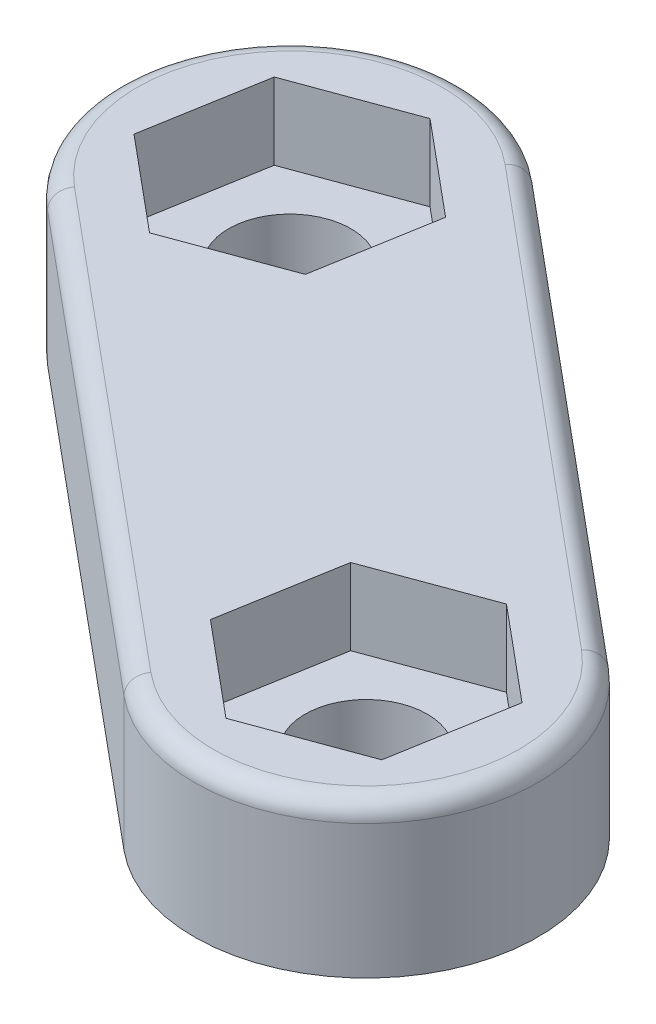
ISO-10303-21;
HEADER;
FILE_DESCRIPTION(('STEP AP214'),'2;1');
FILE_NAME('part.step','',(''),(''),'','','');
FILE_SCHEMA(('AUTOMOTIVE_DESIGN { 1 0 10303 214 1 1 1 1 }'));
ENDSEC;
DATA;
#1=APPLICATION_CONTEXT('core data for automotive mechanical design processes');
#2=APPLICATION_PROTOCOL_DEFINITION('international standard','automotive_design',2000,#1);
#3=PRODUCT_CONTEXT('',#1,'mechanical');
#4=PRODUCT('Part','Part','',(#3));
#5=PRODUCT_RELATED_PRODUCT_CATEGORY('part','',(#4));
#6=PRODUCT_DEFINITION_FORMATION('','',#4);
#7=PRODUCT_DEFINITION_CONTEXT('part definition',#1,'design');
#8=PRODUCT_DEFINITION('design','',#6,#7);
#9=PRODUCT_DEFINITION_SHAPE('','',#8);
#10=(LENGTH_UNIT() NAMED_UNIT(*) SI_UNIT(.MILLI.,.METRE.));
#11=(NAMED_UNIT(*) PLANE_ANGLE_UNIT() SI_UNIT($,.RADIAN.));
#12=(NAMED_UNIT(*) SI_UNIT($,.STERADIAN.) SOLID_ANGLE_UNIT());
#13=UNCERTAINTY_MEASURE_WITH_UNIT(LENGTH_MEASURE(1.E-05),#10,'distance_accuracy_value','');
#14=(GEOMETRIC_REPRESENTATION_CONTEXT(3) GLOBAL_UNCERTAINTY_ASSIGNED_CONTEXT((#13)) GLOBAL_UNIT_ASSIGNED_CONTEXT((#10,
#11,#12)) REPRESENTATION_CONTEXT('',''));
#15=CARTESIAN_POINT('',(0.,0.,0.));
#16=DIRECTION('',(0.,0.,1.));
#17=DIRECTION('',(1.,0.,0.));
#18=AXIS2_PLACEMENT_3D('',#15,#16,#17);
#19=CARTESIAN_POINT('',(-6.,4.,-5.));
#20=DIRECTION('',(0.,-1.,0.));
#21=DIRECTION('',(0.,0.,-1.));
#22=AXIS2_PLACEMENT_3D('',#19,#20,#21);
#23=CYLINDRICAL_SURFACE('',#22,1.6);
#24=CARTESIAN_POINT('',(-6.,0.,-5.));
#25=DIRECTION('',(0.,1.,0.));
#26=DIRECTION('',(0.,0.,1.));
#27=AXIS2_PLACEMENT_3D('',#24,#25,#26);
#28=CIRCLE('',#27,1.6);
#29=CARTESIAN_POINT('',(-6.,0.,-3.4));
#30=VERTEX_POINT('',#29);
#31=EDGE_CURVE('E286',#30,#30,#28,.T.);
#32=ORIENTED_EDGE('',*,*,#31,.F.);
#33=EDGE_LOOP('',(#32));
#34=FACE_BOUND('',#33,.T.);
#35=CARTESIAN_POINT('',(-6.,2.,-5.));
#36=DIRECTION('',(0.,1.,0.));
#37=DIRECTION('',(0.,0.,1.));
#38=AXIS2_PLACEMENT_3D('',#35,#36,#37);
#39=CIRCLE('',#38,1.6);
#40=CARTESIAN_POINT('',(-6.,2.,-3.4));
#41=VERTEX_POINT('',#40);
#42=EDGE_CURVE('E215',#41,#41,#39,.T.);
#43=ORIENTED_EDGE('',*,*,#42,.T.);
#44=EDGE_LOOP('',(#43));
#45=FACE_BOUND('',#44,.T.);
#46=ADVANCED_FACE('F37',(#34,#45),#23,.F.);
#47=CARTESIAN_POINT('',(-2.88082979849016,4.,3.45699575818819));
#48=DIRECTION('',(0.64018439966448,0.,-0.768221279597376));
#49=DIRECTION('',(-0.768221279597376,0.,-0.64018439966448));
#50=AXIS2_PLACEMENT_3D('',#47,#48,#49);
#51=PLANE('',#50);
#52=DIRECTION('',(0.,-1.,0.));
#53=VECTOR('',#52,1.);
#54=CARTESIAN_POINT('',(3.11917020150984,4.,8.45699575818819));
#55=LINE('',#54,#53);
#56=CARTESIAN_POINT('',(3.11917020150984,3.5,8.45699575818819));
#57=VERTEX_POINT('',#56);
#58=CARTESIAN_POINT('',(3.11917020150984,0.,8.45699575818819));
#59=VERTEX_POINT('',#58);
#60=EDGE_CURVE('E295',#57,#59,#55,.T.);
#61=ORIENTED_EDGE('',*,*,#60,.F.);
#62=DIRECTION('',(0.768221279597376,0.,0.64018439966448));
#63=VECTOR('',#62,1.);
#64=CARTESIAN_POINT('',(-8.88082979849016,3.5,-1.54300424181181));
#65=LINE('',#64,#63);
#66=CARTESIAN_POINT('',(-8.88082979849016,3.5,-1.54300424181181));
#67=VERTEX_POINT('',#66);
#68=EDGE_CURVE('E11',#57,#67,#65,.F.);
#69=ORIENTED_EDGE('',*,*,#68,.T.);
#70=DIRECTION('',(0.,-1.,0.));
#71=VECTOR('',#70,1.);
#72=CARTESIAN_POINT('',(-8.88082979849016,4.,-1.54300424181181));
#73=LINE('',#72,#71);
#74=CARTESIAN_POINT('',(-8.88082979849016,0.,-1.54300424181181));
#75=VERTEX_POINT('',#74);
#76=EDGE_CURVE('E289',#67,#75,#73,.T.);
#77=ORIENTED_EDGE('',*,*,#76,.T.);
#78=DIRECTION('',(0.768221279597376,0.,0.64018439966448));
#79=VECTOR('',#78,1.);
#80=CARTESIAN_POINT('',(-2.88082979849016,0.,3.45699575818819));
#81=LINE('',#80,#79);
#82=EDGE_CURVE('E273',#75,#59,#81,.T.);
#83=ORIENTED_EDGE('',*,*,#82,.T.);
#84=EDGE_LOOP('',(#61,#69,#77,#83));
#85=FACE_BOUND('',#84,.T.);
#86=ADVANCED_FACE('F336',(#85),#51,.F.);
#87=CARTESIAN_POINT('',(6.,4.,5.));
#88=DIRECTION('',(0.,-1.,0.));
#89=DIRECTION('',(0.,0.,-1.));
#90=AXIS2_PLACEMENT_3D('',#87,#88,#89);
#91=CYLINDRICAL_SURFACE('',#90,4.5);
#92=DIRECTION('',(0.,-1.,0.));
#93=VECTOR('',#92,1.);
#94=CARTESIAN_POINT('',(8.88082979849016,4.,1.54300424181181));
#95=LINE('',#94,#93);
#96=CARTESIAN_POINT('',(8.88082979849016,3.5,1.54300424181181));
#97=VERTEX_POINT('',#96);
#98=CARTESIAN_POINT('',(8.88082979849016,0.,1.54300424181181));
#99=VERTEX_POINT('',#98);
#100=EDGE_CURVE('E293',#97,#99,#95,.T.);
#101=ORIENTED_EDGE('',*,*,#100,.F.);
#102=CARTESIAN_POINT('',(6.,3.5,5.));
#103=DIRECTION('',(0.,1.,0.));
#104=DIRECTION('',(0.,0.,1.));
#105=AXIS2_PLACEMENT_3D('',#102,#103,#104);
#106=CIRCLE('',#105,4.5);
#107=EDGE_CURVE('E46',#97,#57,#106,.F.);
#108=ORIENTED_EDGE('',*,*,#107,.T.);
#109=ORIENTED_EDGE('',*,*,#60,.T.);
#110=CARTESIAN_POINT('',(6.,0.,5.));
#111=DIRECTION('',(0.,1.,0.));
#112=DIRECTION('',(0.,0.,1.));
#113=AXIS2_PLACEMENT_3D('',#110,#111,#112);
#114=CIRCLE('',#113,4.5);
#115=EDGE_CURVE('E277',#59,#99,#114,.T.);
#116=ORIENTED_EDGE('',*,*,#115,.T.);
#117=EDGE_LOOP('',(#101,#108,#109,#116));
#118=FACE_BOUND('',#117,.T.);
#119=ADVANCED_FACE('F394',(#118),#91,.T.);
#120=CARTESIAN_POINT('',(2.88082979849016,4.,-3.45699575818819));
#121=DIRECTION('',(0.64018439966448,0.,-0.768221279597376));
#122=DIRECTION('',(-0.768221279597376,0.,-0.64018439966448));
#123=AXIS2_PLACEMENT_3D('',#120,#121,#122);
#124=PLANE('',#123);
#125=DIRECTION('',(0.,-1.,0.));
#126=VECTOR('',#125,1.);
#127=CARTESIAN_POINT('',(-3.11917020150984,4.,-8.45699575818819));
#128=LINE('',#127,#126);
#129=CARTESIAN_POINT('',(-3.11917020150984,3.5,-8.45699575818819));
#130=VERTEX_POINT('',#129);
#131=CARTESIAN_POINT('',(-3.11917020150984,0.,-8.45699575818819));
#132=VERTEX_POINT('',#131);
#133=EDGE_CURVE('E291',#130,#132,#128,.T.);
#134=ORIENTED_EDGE('',*,*,#133,.F.);
#135=DIRECTION('',(0.768221279597376,0.,0.64018439966448));
#136=VECTOR('',#135,1.);
#137=CARTESIAN_POINT('',(2.88082979849016,3.5,-3.45699575818819));
#138=LINE('',#137,#136);
#139=EDGE_CURVE('E61',#130,#97,#138,.T.);
#140=ORIENTED_EDGE('',*,*,#139,.T.);
#141=ORIENTED_EDGE('',*,*,#100,.T.);
#142=DIRECTION('',(0.768221279597376,0.,0.64018439966448));
#143=VECTOR('',#142,1.);
#144=CARTESIAN_POINT('',(2.88082979849016,0.,-3.45699575818819));
#145=LINE('',#144,#143);
#146=EDGE_CURVE('E280',#132,#99,#145,.T.);
#147=ORIENTED_EDGE('',*,*,#146,.F.);
#148=EDGE_LOOP('',(#134,#140,#141,#147));
#149=FACE_BOUND('',#148,.T.);
#150=ADVANCED_FACE('F402',(#149),#124,.T.);
#151=CARTESIAN_POINT('',(-6.,4.,-5.));
#152=DIRECTION('',(0.,-1.,0.));
#153=DIRECTION('',(0.,0.,-1.));
#154=AXIS2_PLACEMENT_3D('',#151,#152,#153);
#155=CYLINDRICAL_SURFACE('',#154,4.5);
#156=ORIENTED_EDGE('',*,*,#76,.F.);
#157=CARTESIAN_POINT('',(-6.,3.5,-5.));
#158=DIRECTION('',(0.,1.,0.));
#159=DIRECTION('',(0.,0.,1.));
#160=AXIS2_PLACEMENT_3D('',#157,#158,#159);
#161=CIRCLE('',#160,4.5);
#162=EDGE_CURVE('E310',#67,#130,#161,.F.);
#163=ORIENTED_EDGE('',*,*,#162,.T.);
#164=ORIENTED_EDGE('',*,*,#133,.T.);
#165=CARTESIAN_POINT('',(-6.,0.,-5.));
#166=DIRECTION('',(0.,1.,0.));
#167=DIRECTION('',(0.,0.,1.));
#168=AXIS2_PLACEMENT_3D('',#165,#166,#167);
#169=CIRCLE('',#168,4.5);
#170=EDGE_CURVE('E283',#132,#75,#169,.T.);
#171=ORIENTED_EDGE('',*,*,#170,.T.);
#172=EDGE_LOOP('',(#156,#163,#164,#171));
#173=FACE_BOUND('',#172,.T.);
#174=ADVANCED_FACE('F339',(#173),#155,.T.);
#175=CARTESIAN_POINT('',(6.,4.,5.));
#176=DIRECTION('',(0.,-1.,0.));
#177=DIRECTION('',(0.,0.,-1.));
#178=AXIS2_PLACEMENT_3D('',#175,#176,#177);
#179=CYLINDRICAL_SURFACE('',#178,1.6);
#180=CARTESIAN_POINT('',(6.,2.,5.));
#181=DIRECTION('',(0.,-1.,0.));
#182=DIRECTION('',(0.,0.,-1.));
#183=AXIS2_PLACEMENT_3D('',#180,#181,#182);
#184=CIRCLE('',#183,1.6);
#185=CARTESIAN_POINT('',(6.,2.,3.4));
#186=VERTEX_POINT('',#185);
#187=EDGE_CURVE('E274',#186,#186,#184,.T.);
#188=ORIENTED_EDGE('',*,*,#187,.F.);
#189=EDGE_LOOP('',(#188));
#190=FACE_BOUND('',#189,.T.);
#191=CARTESIAN_POINT('',(6.,0.,5.));
#192=DIRECTION('',(0.,1.,0.));
#193=DIRECTION('',(0.,0.,1.));
#194=AXIS2_PLACEMENT_3D('',#191,#192,#193);
#195=CIRCLE('',#194,1.6);
#196=CARTESIAN_POINT('',(6.,0.,6.6));
#197=VERTEX_POINT('',#196);
#198=EDGE_CURVE('E270',#197,#197,#195,.T.);
#199=ORIENTED_EDGE('',*,*,#198,.F.);
#200=EDGE_LOOP('',(#199));
#201=FACE_BOUND('',#200,.T.);
#202=ADVANCED_FACE('F350',(#190,#201),#179,.F.);
#203=CARTESIAN_POINT('',(0.,4.,0.));
#204=DIRECTION('',(0.,1.,0.));
#205=DIRECTION('',(0.,0.,1.));
#206=AXIS2_PLACEMENT_3D('',#203,#204,#205);
#207=PLANE('',#206);
#208=DIRECTION('',(0.768221279597376,0.,0.64018439966448));
#209=VECTOR('',#208,1.);
#210=CARTESIAN_POINT('',(2.56073759865792,4.,-3.0728851183895));
#211=LINE('',#210,#209);
#212=CARTESIAN_POINT('',(8.56073759865792,4.,1.9271148816105));
#213=VERTEX_POINT('',#212);
#214=CARTESIAN_POINT('',(-3.43926240134208,4.,-8.0728851183895));
#215=VERTEX_POINT('',#214);
#216=EDGE_CURVE('E305',#213,#215,#211,.F.);
#217=ORIENTED_EDGE('',*,*,#216,.T.);
#218=CARTESIAN_POINT('',(-6.,4.,-5.));
#219=DIRECTION('',(0.,1.,0.));
#220=DIRECTION('',(0.,0.,1.));
#221=AXIS2_PLACEMENT_3D('',#218,#219,#220);
#222=CIRCLE('',#221,4.);
#223=CARTESIAN_POINT('',(-8.56073759865792,4.,-1.9271148816105));
#224=VERTEX_POINT('',#223);
#225=EDGE_CURVE('E307',#215,#224,#222,.T.);
#226=ORIENTED_EDGE('',*,*,#225,.T.);
#227=DIRECTION('',(0.768221279597376,0.,0.64018439966448));
#228=VECTOR('',#227,1.);
#229=CARTESIAN_POINT('',(3.43926240134208,4.,8.0728851183895));
#230=LINE('',#229,#228);
#231=CARTESIAN_POINT('',(3.43926240134208,4.,8.0728851183895));
#232=VERTEX_POINT('',#231);
#233=EDGE_CURVE('E297',#224,#232,#230,.T.);
#234=ORIENTED_EDGE('',*,*,#233,.T.);
#235=CARTESIAN_POINT('',(6.,4.,5.));
#236=DIRECTION('',(0.,1.,0.));
#237=DIRECTION('',(0.,0.,1.));
#238=AXIS2_PLACEMENT_3D('',#235,#236,#237);
#239=CIRCLE('',#238,4.);
#240=EDGE_CURVE('E303',#232,#213,#239,.T.);
#241=ORIENTED_EDGE('',*,*,#240,.T.);
#242=EDGE_LOOP('',(#217,#226,#234,#241));
#243=FACE_BOUND('',#242,.T.);
#244=DIRECTION('',(-0.938526593014617,0.,0.345206944026876));
#245=VECTOR('',#244,1.);
#246=CARTESIAN_POINT('',(-5.45920799799773,4.,-8.12903776645532));
#247=LINE('',#246,#245);
#248=CARTESIAN_POINT('',(-5.45920799799773,4.,-8.12903776645532));
#249=VERTEX_POINT('',#248);
#250=CARTESIAN_POINT('',(-8.43943019415009,4.,-7.03285849512508));
#251=VERTEX_POINT('',#250);
#252=EDGE_CURVE('E170',#249,#251,#247,.T.);
#253=ORIENTED_EDGE('',*,*,#252,.F.);
#254=DIRECTION('',(-0.768221279597376,0.,-0.64018439966448));
#255=VECTOR('',#254,1.);
#256=CARTESIAN_POINT('',(-3.01977780384764,4.,-6.09617927133025));
#257=LINE('',#256,#255);
#258=CARTESIAN_POINT('',(-3.01977780384764,4.,-6.09617927133025));
#259=VERTEX_POINT('',#258);
#260=EDGE_CURVE('E188',#259,#249,#257,.T.);
#261=ORIENTED_EDGE('',*,*,#260,.F.);
#262=DIRECTION('',(0.170305313417241,0.,-0.985391343691356));
#263=VECTOR('',#262,1.);
#264=CARTESIAN_POINT('',(-3.56056980584991,4.,-2.96714150487492));
#265=LINE('',#264,#263);
#266=CARTESIAN_POINT('',(-3.56056980584991,4.,-2.96714150487492));
#267=VERTEX_POINT('',#266);
#268=EDGE_CURVE('E191',#267,#259,#265,.T.);
#269=ORIENTED_EDGE('',*,*,#268,.F.);
#270=DIRECTION('',(0.938526593014617,0.,-0.345206944026876));
#271=VECTOR('',#270,1.);
#272=CARTESIAN_POINT('',(-6.54079200200227,4.,-1.87096223354468));
#273=LINE('',#272,#271);
#274=CARTESIAN_POINT('',(-6.54079200200227,4.,-1.87096223354468));
#275=VERTEX_POINT('',#274);
#276=EDGE_CURVE('E208',#275,#267,#273,.T.);
#277=ORIENTED_EDGE('',*,*,#276,.F.);
#278=DIRECTION('',(0.768221279597376,0.,0.64018439966448));
#279=VECTOR('',#278,1.);
#280=CARTESIAN_POINT('',(-8.98022219615236,4.,-3.90382072866975));
#281=LINE('',#280,#279);
#282=CARTESIAN_POINT('',(-8.98022219615236,4.,-3.90382072866975));
#283=VERTEX_POINT('',#282);
#284=EDGE_CURVE('E205',#283,#275,#281,.T.);
#285=ORIENTED_EDGE('',*,*,#284,.F.);
#286=DIRECTION('',(-0.170305313417241,0.,0.985391343691356));
#287=VECTOR('',#286,1.);
#288=CARTESIAN_POINT('',(-8.43943019415009,4.,-7.03285849512508));
#289=LINE('',#288,#287);
#290=EDGE_CURVE('E202',#251,#283,#289,.T.);
#291=ORIENTED_EDGE('',*,*,#290,.F.);
#292=EDGE_LOOP('',(#253,#261,#269,#277,#285,#291));
#293=FACE_BOUND('',#292,.T.);
#294=DIRECTION('',(0.938526593014617,0.,-0.345206944026876));
#295=VECTOR('',#294,1.);
#296=CARTESIAN_POINT('',(8.43943019415009,4.,7.03285849512507));
#297=LINE('',#296,#295);
#298=CARTESIAN_POINT('',(5.45920799799773,4.,8.12903776645532));
#299=VERTEX_POINT('',#298);
#300=CARTESIAN_POINT('',(8.43943019415009,4.,7.03285849512507));
#301=VERTEX_POINT('',#300);
#302=EDGE_CURVE('E243',#299,#301,#297,.T.);
#303=ORIENTED_EDGE('',*,*,#302,.F.);
#304=DIRECTION('',(0.768221279597376,0.,0.64018439966448));
#305=VECTOR('',#304,1.);
#306=CARTESIAN_POINT('',(5.45920799799773,4.,8.12903776645532));
#307=LINE('',#306,#305);
#308=CARTESIAN_POINT('',(3.01977780384764,4.,6.09617927133024));
#309=VERTEX_POINT('',#308);
#310=EDGE_CURVE('E227',#309,#299,#307,.T.);
#311=ORIENTED_EDGE('',*,*,#310,.F.);
#312=DIRECTION('',(-0.170305313417241,0.,0.985391343691356));
#313=VECTOR('',#312,1.);
#314=CARTESIAN_POINT('',(3.01977780384764,4.,6.09617927133024));
#315=LINE('',#314,#313);
#316=CARTESIAN_POINT('',(3.56056980584991,4.,2.96714150487492));
#317=VERTEX_POINT('',#316);
#318=EDGE_CURVE('E254',#317,#309,#315,.T.);
#319=ORIENTED_EDGE('',*,*,#318,.F.);
#320=DIRECTION('',(-0.938526593014617,0.,0.345206944026876));
#321=VECTOR('',#320,1.);
#322=CARTESIAN_POINT('',(3.56056980584991,4.,2.96714150487492));
#323=LINE('',#322,#321);
#324=CARTESIAN_POINT('',(6.54079200200228,4.,1.87096223354468));
#325=VERTEX_POINT('',#324);
#326=EDGE_CURVE('E251',#325,#317,#323,.T.);
#327=ORIENTED_EDGE('',*,*,#326,.F.);
#328=DIRECTION('',(-0.768221279597376,0.,-0.64018439966448));
#329=VECTOR('',#328,1.);
#330=CARTESIAN_POINT('',(6.54079200200228,4.,1.87096223354468));
#331=LINE('',#330,#329);
#332=CARTESIAN_POINT('',(8.98022219615237,4.,3.90382072866975));
#333=VERTEX_POINT('',#332);
#334=EDGE_CURVE('E248',#333,#325,#331,.T.);
#335=ORIENTED_EDGE('',*,*,#334,.F.);
#336=DIRECTION('',(0.170305313417242,0.,-0.985391343691355));
#337=VECTOR('',#336,1.);
#338=CARTESIAN_POINT('',(8.98022219615237,4.,3.90382072866975));
#339=LINE('',#338,#337);
#340=EDGE_CURVE('E245',#301,#333,#339,.T.);
#341=ORIENTED_EDGE('',*,*,#340,.F.);
#342=EDGE_LOOP('',(#303,#311,#319,#327,#335,#341));
#343=FACE_BOUND('',#342,.T.);
#344=ADVANCED_FACE('F346',(#243,#293,#343),#207,.T.);
#345=CARTESIAN_POINT('',(0.,0.,0.));
#346=DIRECTION('',(0.,1.,0.));
#347=DIRECTION('',(0.,0.,1.));
#348=AXIS2_PLACEMENT_3D('',#345,#346,#347);
#349=PLANE('',#348);
#350=ORIENTED_EDGE('',*,*,#198,.T.);
#351=EDGE_LOOP('',(#350));
#352=FACE_BOUND('',#351,.T.);
#353=ORIENTED_EDGE('',*,*,#82,.F.);
#354=ORIENTED_EDGE('',*,*,#170,.F.);
#355=ORIENTED_EDGE('',*,*,#146,.T.);
#356=ORIENTED_EDGE('',*,*,#115,.F.);
#357=EDGE_LOOP('',(#353,#354,#355,#356));
#358=FACE_BOUND('',#357,.T.);
#359=ORIENTED_EDGE('',*,*,#31,.T.);
#360=EDGE_LOOP('',(#359));
#361=FACE_BOUND('',#360,.T.);
#362=ADVANCED_FACE('F349',(#352,#358,#361),#349,.F.);
#363=CARTESIAN_POINT('',(8.43943019415009,2.,7.03285849512507));
#364=DIRECTION('',(0.345206944026876,0.,0.938526593014617));
#365=DIRECTION('',(0.938526593014617,0.,-0.345206944026876));
#366=AXIS2_PLACEMENT_3D('',#363,#364,#365);
#367=PLANE('',#366);
#368=ORIENTED_EDGE('',*,*,#302,.T.);
#369=DIRECTION('',(0.,1.,0.));
#370=VECTOR('',#369,1.);
#371=CARTESIAN_POINT('',(8.43943019415009,2.,7.03285849512507));
#372=LINE('',#371,#370);
#373=CARTESIAN_POINT('',(8.43943019415009,2.,7.03285849512507));
#374=VERTEX_POINT('',#373);
#375=EDGE_CURVE('E242',#374,#301,#372,.T.);
#376=ORIENTED_EDGE('',*,*,#375,.F.);
#377=DIRECTION('',(0.938526593014617,0.,-0.345206944026876));
#378=VECTOR('',#377,1.);
#379=CARTESIAN_POINT('',(8.43943019415009,2.,7.03285849512507));
#380=LINE('',#379,#378);
#381=CARTESIAN_POINT('',(5.45920799799773,2.,8.12903776645532));
#382=VERTEX_POINT('',#381);
#383=EDGE_CURVE('E223',#382,#374,#380,.T.);
#384=ORIENTED_EDGE('',*,*,#383,.F.);
#385=DIRECTION('',(0.,1.,0.));
#386=VECTOR('',#385,1.);
#387=CARTESIAN_POINT('',(5.45920799799773,2.,8.12903776645532));
#388=LINE('',#387,#386);
#389=EDGE_CURVE('E203',#382,#299,#388,.T.);
#390=ORIENTED_EDGE('',*,*,#389,.T.);
#391=EDGE_LOOP('',(#368,#376,#384,#390));
#392=FACE_BOUND('',#391,.T.);
#393=ADVANCED_FACE('F360',(#392),#367,.F.);
#394=CARTESIAN_POINT('',(5.45920799799773,2.,8.12903776645532));
#395=DIRECTION('',(-0.64018439966448,0.,0.768221279597376));
#396=DIRECTION('',(0.768221279597376,0.,0.64018439966448));
#397=AXIS2_PLACEMENT_3D('',#394,#395,#396);
#398=PLANE('',#397);
#399=ORIENTED_EDGE('',*,*,#310,.T.);
#400=ORIENTED_EDGE('',*,*,#389,.F.);
#401=DIRECTION('',(0.768221279597376,0.,0.64018439966448));
#402=VECTOR('',#401,1.);
#403=CARTESIAN_POINT('',(5.45920799799773,2.,8.12903776645532));
#404=LINE('',#403,#402);
#405=CARTESIAN_POINT('',(3.01977780384764,2.,6.09617927133024));
#406=VERTEX_POINT('',#405);
#407=EDGE_CURVE('E239',#406,#382,#404,.T.);
#408=ORIENTED_EDGE('',*,*,#407,.F.);
#409=DIRECTION('',(0.,1.,0.));
#410=VECTOR('',#409,1.);
#411=CARTESIAN_POINT('',(3.01977780384764,2.,6.09617927133024));
#412=LINE('',#411,#410);
#413=EDGE_CURVE('E260',#406,#309,#412,.T.);
#414=ORIENTED_EDGE('',*,*,#413,.T.);
#415=EDGE_LOOP('',(#399,#400,#408,#414));
#416=FACE_BOUND('',#415,.T.);
#417=ADVANCED_FACE('F371',(#416),#398,.F.);
#418=CARTESIAN_POINT('',(3.01977780384764,2.,6.09617927133024));
#419=DIRECTION('',(-0.985391343691356,0.,-0.170305313417241));
#420=DIRECTION('',(-0.170305313417241,0.,0.985391343691356));
#421=AXIS2_PLACEMENT_3D('',#418,#419,#420);
#422=PLANE('',#421);
#423=ORIENTED_EDGE('',*,*,#318,.T.);
#424=ORIENTED_EDGE('',*,*,#413,.F.);
#425=DIRECTION('',(-0.170305313417241,0.,0.985391343691356));
#426=VECTOR('',#425,1.);
#427=CARTESIAN_POINT('',(3.01977780384764,2.,6.09617927133024));
#428=LINE('',#427,#426);
#429=CARTESIAN_POINT('',(3.56056980584991,2.,2.96714150487492));
#430=VERTEX_POINT('',#429);
#431=EDGE_CURVE('E236',#430,#406,#428,.T.);
#432=ORIENTED_EDGE('',*,*,#431,.F.);
#433=DIRECTION('',(0.,1.,0.));
#434=VECTOR('',#433,1.);
#435=CARTESIAN_POINT('',(3.56056980584991,2.,2.96714150487492));
#436=LINE('',#435,#434);
#437=EDGE_CURVE('E262',#430,#317,#436,.T.);
#438=ORIENTED_EDGE('',*,*,#437,.T.);
#439=EDGE_LOOP('',(#423,#424,#432,#438));
#440=FACE_BOUND('',#439,.T.);
#441=ADVANCED_FACE('F373',(#440),#422,.F.);
#442=CARTESIAN_POINT('',(3.56056980584991,2.,2.96714150487492));
#443=DIRECTION('',(-0.345206944026876,0.,-0.938526593014618));
#444=DIRECTION('',(-0.938526593014618,0.,0.345206944026876));
#445=AXIS2_PLACEMENT_3D('',#442,#443,#444);
#446=PLANE('',#445);
#447=ORIENTED_EDGE('',*,*,#326,.T.);
#448=ORIENTED_EDGE('',*,*,#437,.F.);
#449=DIRECTION('',(-0.938526593014617,0.,0.345206944026876));
#450=VECTOR('',#449,1.);
#451=CARTESIAN_POINT('',(3.56056980584991,2.,2.96714150487492));
#452=LINE('',#451,#450);
#453=CARTESIAN_POINT('',(6.54079200200228,2.,1.87096223354468));
#454=VERTEX_POINT('',#453);
#455=EDGE_CURVE('E233',#454,#430,#452,.T.);
#456=ORIENTED_EDGE('',*,*,#455,.F.);
#457=DIRECTION('',(0.,1.,0.));
#458=VECTOR('',#457,1.);
#459=CARTESIAN_POINT('',(6.54079200200228,2.,1.87096223354468));
#460=LINE('',#459,#458);
#461=EDGE_CURVE('E264',#454,#325,#460,.T.);
#462=ORIENTED_EDGE('',*,*,#461,.T.);
#463=EDGE_LOOP('',(#447,#448,#456,#462));
#464=FACE_BOUND('',#463,.T.);
#465=ADVANCED_FACE('F376',(#464),#446,.F.);
#466=CARTESIAN_POINT('',(6.54079200200228,2.,1.87096223354468));
#467=DIRECTION('',(0.64018439966448,0.,-0.768221279597376));
#468=DIRECTION('',(-0.768221279597376,0.,-0.64018439966448));
#469=AXIS2_PLACEMENT_3D('',#466,#467,#468);
#470=PLANE('',#469);
#471=ORIENTED_EDGE('',*,*,#334,.T.);
#472=ORIENTED_EDGE('',*,*,#461,.F.);
#473=DIRECTION('',(-0.768221279597376,0.,-0.64018439966448));
#474=VECTOR('',#473,1.);
#475=CARTESIAN_POINT('',(6.54079200200228,2.,1.87096223354468));
#476=LINE('',#475,#474);
#477=CARTESIAN_POINT('',(8.98022219615237,2.,3.90382072866975));
#478=VERTEX_POINT('',#477);
#479=EDGE_CURVE('E230',#478,#454,#476,.T.);
#480=ORIENTED_EDGE('',*,*,#479,.F.);
#481=DIRECTION('',(0.,1.,0.));
#482=VECTOR('',#481,1.);
#483=CARTESIAN_POINT('',(8.98022219615237,2.,3.90382072866975));
#484=LINE('',#483,#482);
#485=EDGE_CURVE('E266',#478,#333,#484,.T.);
#486=ORIENTED_EDGE('',*,*,#485,.T.);
#487=EDGE_LOOP('',(#471,#472,#480,#486));
#488=FACE_BOUND('',#487,.T.);
#489=ADVANCED_FACE('F379',(#488),#470,.F.);
#490=CARTESIAN_POINT('',(8.98022219615237,2.,3.90382072866975));
#491=DIRECTION('',(0.985391343691356,0.,0.170305313417242));
#492=DIRECTION('',(0.170305313417242,0.,-0.985391343691356));
#493=AXIS2_PLACEMENT_3D('',#490,#491,#492);
#494=PLANE('',#493);
#495=ORIENTED_EDGE('',*,*,#340,.T.);
#496=ORIENTED_EDGE('',*,*,#485,.F.);
#497=DIRECTION('',(0.170305313417242,0.,-0.985391343691355));
#498=VECTOR('',#497,1.);
#499=CARTESIAN_POINT('',(8.98022219615237,2.,3.90382072866975));
#500=LINE('',#499,#498);
#501=EDGE_CURVE('E226',#374,#478,#500,.T.);
#502=ORIENTED_EDGE('',*,*,#501,.F.);
#503=ORIENTED_EDGE('',*,*,#375,.T.);
#504=EDGE_LOOP('',(#495,#496,#502,#503));
#505=FACE_BOUND('',#504,.T.);
#506=ADVANCED_FACE('F364',(#505),#494,.F.);
#507=CARTESIAN_POINT('',(0.,2.,0.));
#508=DIRECTION('',(0.,-1.,0.));
#509=DIRECTION('',(0.,0.,-1.));
#510=AXIS2_PLACEMENT_3D('',#507,#508,#509);
#511=PLANE('',#510);
#512=ORIENTED_EDGE('',*,*,#187,.T.);
#513=EDGE_LOOP('',(#512));
#514=FACE_BOUND('',#513,.T.);
#515=ORIENTED_EDGE('',*,*,#383,.T.);
#516=ORIENTED_EDGE('',*,*,#501,.T.);
#517=ORIENTED_EDGE('',*,*,#479,.T.);
#518=ORIENTED_EDGE('',*,*,#455,.T.);
#519=ORIENTED_EDGE('',*,*,#431,.T.);
#520=ORIENTED_EDGE('',*,*,#407,.T.);
#521=EDGE_LOOP('',(#515,#516,#517,#518,#519,#520));
#522=FACE_BOUND('',#521,.T.);
#523=ADVANCED_FACE('F367',(#514,#522),#511,.F.);
#524=CARTESIAN_POINT('',(-5.45920799799773,2.,-8.12903776645532));
#525=DIRECTION('',(-0.345206944026876,0.,-0.938526593014617));
#526=DIRECTION('',(-0.938526593014618,0.,0.345206944026876));
#527=AXIS2_PLACEMENT_3D('',#524,#525,#526);
#528=PLANE('',#527);
#529=ORIENTED_EDGE('',*,*,#252,.T.);
#530=DIRECTION('',(0.,1.,0.));
#531=VECTOR('',#530,1.);
#532=CARTESIAN_POINT('',(-8.43943019415009,2.,-7.03285849512508));
#533=LINE('',#532,#531);
#534=CARTESIAN_POINT('',(-8.43943019415009,2.,-7.03285849512508));
#535=VERTEX_POINT('',#534);
#536=EDGE_CURVE('E163',#535,#251,#533,.T.);
#537=ORIENTED_EDGE('',*,*,#536,.F.);
#538=DIRECTION('',(-0.938526593014617,0.,0.345206944026876));
#539=VECTOR('',#538,1.);
#540=CARTESIAN_POINT('',(-5.45920799799773,2.,-8.12903776645532));
#541=LINE('',#540,#539);
#542=CARTESIAN_POINT('',(-5.45920799799773,2.,-8.12903776645532));
#543=VERTEX_POINT('',#542);
#544=EDGE_CURVE('E167',#543,#535,#541,.T.);
#545=ORIENTED_EDGE('',*,*,#544,.F.);
#546=DIRECTION('',(0.,1.,0.));
#547=VECTOR('',#546,1.);
#548=CARTESIAN_POINT('',(-5.45920799799773,2.,-8.12903776645532));
#549=LINE('',#548,#547);
#550=EDGE_CURVE('E213',#543,#249,#549,.T.);
#551=ORIENTED_EDGE('',*,*,#550,.T.);
#552=EDGE_LOOP('',(#529,#537,#545,#551));
#553=FACE_BOUND('',#552,.T.);
#554=ADVANCED_FACE('F165',(#553),#528,.F.);
#555=CARTESIAN_POINT('',(-3.01977780384764,2.,-6.09617927133025));
#556=DIRECTION('',(0.64018439966448,0.,-0.768221279597376));
#557=DIRECTION('',(-0.768221279597376,0.,-0.64018439966448));
#558=AXIS2_PLACEMENT_3D('',#555,#556,#557);
#559=PLANE('',#558);
#560=ORIENTED_EDGE('',*,*,#260,.T.);
#561=ORIENTED_EDGE('',*,*,#550,.F.);
#562=DIRECTION('',(-0.768221279597376,0.,-0.64018439966448));
#563=VECTOR('',#562,1.);
#564=CARTESIAN_POINT('',(-3.01977780384764,2.,-6.09617927133025));
#565=LINE('',#564,#563);
#566=CARTESIAN_POINT('',(-3.01977780384764,2.,-6.09617927133025));
#567=VERTEX_POINT('',#566);
#568=EDGE_CURVE('E175',#567,#543,#565,.T.);
#569=ORIENTED_EDGE('',*,*,#568,.F.);
#570=DIRECTION('',(0.,1.,0.));
#571=VECTOR('',#570,1.);
#572=CARTESIAN_POINT('',(-3.01977780384764,2.,-6.09617927133025));
#573=LINE('',#572,#571);
#574=EDGE_CURVE('E216',#567,#259,#573,.T.);
#575=ORIENTED_EDGE('',*,*,#574,.T.);
#576=EDGE_LOOP('',(#560,#561,#569,#575));
#577=FACE_BOUND('',#576,.T.);
#578=ADVANCED_FACE('F429',(#577),#559,.F.);
#579=CARTESIAN_POINT('',(-3.56056980584991,2.,-2.96714150487492));
#580=DIRECTION('',(0.985391343691356,0.,0.170305313417241));
#581=DIRECTION('',(0.170305313417241,0.,-0.985391343691356));
#582=AXIS2_PLACEMENT_3D('',#579,#580,#581);
#583=PLANE('',#582);
#584=ORIENTED_EDGE('',*,*,#268,.T.);
#585=ORIENTED_EDGE('',*,*,#574,.F.);
#586=DIRECTION('',(0.170305313417241,0.,-0.985391343691356));
#587=VECTOR('',#586,1.);
#588=CARTESIAN_POINT('',(-3.56056980584991,2.,-2.96714150487492));
#589=LINE('',#588,#587);
#590=CARTESIAN_POINT('',(-3.56056980584991,2.,-2.96714150487492));
#591=VERTEX_POINT('',#590);
#592=EDGE_CURVE('E198',#591,#567,#589,.T.);
#593=ORIENTED_EDGE('',*,*,#592,.F.);
#594=DIRECTION('',(0.,1.,0.));
#595=VECTOR('',#594,1.);
#596=CARTESIAN_POINT('',(-3.56056980584991,2.,-2.96714150487492));
#597=LINE('',#596,#595);
#598=EDGE_CURVE('E218',#591,#267,#597,.T.);
#599=ORIENTED_EDGE('',*,*,#598,.T.);
#600=EDGE_LOOP('',(#584,#585,#593,#599));
#601=FACE_BOUND('',#600,.T.);
#602=ADVANCED_FACE('F432',(#601),#583,.F.);
#603=CARTESIAN_POINT('',(-6.54079200200227,2.,-1.87096223354468));
#604=DIRECTION('',(0.345206944026876,0.,0.938526593014617));
#605=DIRECTION('',(0.938526593014618,0.,-0.345206944026876));
#606=AXIS2_PLACEMENT_3D('',#603,#604,#605);
#607=PLANE('',#606);
#608=ORIENTED_EDGE('',*,*,#276,.T.);
#609=ORIENTED_EDGE('',*,*,#598,.F.);
#610=DIRECTION('',(0.938526593014617,0.,-0.345206944026876));
#611=VECTOR('',#610,1.);
#612=CARTESIAN_POINT('',(-6.54079200200227,2.,-1.87096223354468));
#613=LINE('',#612,#611);
#614=CARTESIAN_POINT('',(-6.54079200200227,2.,-1.87096223354468));
#615=VERTEX_POINT('',#614);
#616=EDGE_CURVE('E195',#615,#591,#613,.T.);
#617=ORIENTED_EDGE('',*,*,#616,.F.);
#618=DIRECTION('',(0.,1.,0.));
#619=VECTOR('',#618,1.);
#620=CARTESIAN_POINT('',(-6.54079200200227,2.,-1.87096223354468));
#621=LINE('',#620,#619);
#622=EDGE_CURVE('E220',#615,#275,#621,.T.);
#623=ORIENTED_EDGE('',*,*,#622,.T.);
#624=EDGE_LOOP('',(#608,#609,#617,#623));
#625=FACE_BOUND('',#624,.T.);
#626=ADVANCED_FACE('F436',(#625),#607,.F.);
#627=CARTESIAN_POINT('',(-8.98022219615236,2.,-3.90382072866975));
#628=DIRECTION('',(-0.64018439966448,0.,0.768221279597376));
#629=DIRECTION('',(0.768221279597376,0.,0.64018439966448));
#630=AXIS2_PLACEMENT_3D('',#627,#628,#629);
#631=PLANE('',#630);
#632=ORIENTED_EDGE('',*,*,#284,.T.);
#633=ORIENTED_EDGE('',*,*,#622,.F.);
#634=DIRECTION('',(0.768221279597376,0.,0.64018439966448));
#635=VECTOR('',#634,1.);
#636=CARTESIAN_POINT('',(-8.98022219615236,2.,-3.90382072866975));
#637=LINE('',#636,#635);
#638=CARTESIAN_POINT('',(-8.98022219615236,2.,-3.90382072866975));
#639=VERTEX_POINT('',#638);
#640=EDGE_CURVE('E183',#639,#615,#637,.T.);
#641=ORIENTED_EDGE('',*,*,#640,.F.);
#642=DIRECTION('',(0.,1.,0.));
#643=VECTOR('',#642,1.);
#644=CARTESIAN_POINT('',(-8.98022219615236,2.,-3.90382072866975));
#645=LINE('',#644,#643);
#646=EDGE_CURVE('E174',#639,#283,#645,.T.);
#647=ORIENTED_EDGE('',*,*,#646,.T.);
#648=EDGE_LOOP('',(#632,#633,#641,#647));
#649=FACE_BOUND('',#648,.T.);
#650=ADVANCED_FACE('F425',(#649),#631,.F.);
#651=CARTESIAN_POINT('',(-8.43943019415009,2.,-7.03285849512508));
#652=DIRECTION('',(-0.985391343691356,0.,-0.170305313417241));
#653=DIRECTION('',(-0.170305313417241,0.,0.985391343691356));
#654=AXIS2_PLACEMENT_3D('',#651,#652,#653);
#655=PLANE('',#654);
#656=ORIENTED_EDGE('',*,*,#290,.T.);
#657=ORIENTED_EDGE('',*,*,#646,.F.);
#658=DIRECTION('',(-0.170305313417241,0.,0.985391343691356));
#659=VECTOR('',#658,1.);
#660=CARTESIAN_POINT('',(-8.43943019415009,2.,-7.03285849512508));
#661=LINE('',#660,#659);
#662=EDGE_CURVE('E178',#535,#639,#661,.T.);
#663=ORIENTED_EDGE('',*,*,#662,.F.);
#664=ORIENTED_EDGE('',*,*,#536,.T.);
#665=EDGE_LOOP('',(#656,#657,#663,#664));
#666=FACE_BOUND('',#665,.T.);
#667=ADVANCED_FACE('F179',(#666),#655,.F.);
#668=CARTESIAN_POINT('',(0.,2.,0.));
#669=DIRECTION('',(0.,1.,0.));
#670=DIRECTION('',(0.,0.,1.));
#671=AXIS2_PLACEMENT_3D('',#668,#669,#670);
#672=PLANE('',#671);
#673=ORIENTED_EDGE('',*,*,#42,.F.);
#674=EDGE_LOOP('',(#673));
#675=FACE_BOUND('',#674,.T.);
#676=ORIENTED_EDGE('',*,*,#544,.T.);
#677=ORIENTED_EDGE('',*,*,#662,.T.);
#678=ORIENTED_EDGE('',*,*,#640,.T.);
#679=ORIENTED_EDGE('',*,*,#616,.T.);
#680=ORIENTED_EDGE('',*,*,#592,.T.);
#681=ORIENTED_EDGE('',*,*,#568,.T.);
#682=EDGE_LOOP('',(#676,#677,#678,#679,#680,#681));
#683=FACE_BOUND('',#682,.T.);
#684=ADVANCED_FACE('F185',(#675,#683),#672,.T.);
#685=CARTESIAN_POINT('',(6.,3.5,5.));
#686=DIRECTION('',(0.,1.,0.));
#687=DIRECTION('',(0.,0.,1.));
#688=AXIS2_PLACEMENT_3D('',#685,#686,#687);
#689=TOROIDAL_SURFACE('',#688,4.,0.5);
#690=CARTESIAN_POINT('',(3.43926240134208,3.5,8.0728851183895));
#691=DIRECTION('',(-0.768221279597376,0.,-0.64018439966448));
#692=DIRECTION('',(-0.64018439966448,0.,0.768221279597376));
#693=AXIS2_PLACEMENT_3D('',#690,#691,#692);
#694=CIRCLE('',#693,0.5);
#695=EDGE_CURVE('E318',#57,#232,#694,.T.);
#696=ORIENTED_EDGE('',*,*,#695,.F.);
#697=ORIENTED_EDGE('',*,*,#107,.F.);
#698=CARTESIAN_POINT('',(8.56073759865792,3.5,1.9271148816105));
#699=DIRECTION('',(-0.768221279597376,0.,-0.64018439966448));
#700=DIRECTION('',(-0.64018439966448,0.,0.768221279597376));
#701=AXIS2_PLACEMENT_3D('',#698,#699,#700);
#702=CIRCLE('',#701,0.5);
#703=EDGE_CURVE('E41',#213,#97,#702,.T.);
#704=ORIENTED_EDGE('',*,*,#703,.F.);
#705=ORIENTED_EDGE('',*,*,#240,.F.);
#706=EDGE_LOOP('',(#696,#697,#704,#705));
#707=FACE_BOUND('',#706,.T.);
#708=ADVANCED_FACE('F39',(#707),#689,.T.);
#709=CARTESIAN_POINT('',(2.56073759865792,3.5,-3.0728851183895));
#710=DIRECTION('',(0.768221279597376,0.,0.64018439966448));
#711=DIRECTION('',(0.64018439966448,0.,-0.768221279597376));
#712=AXIS2_PLACEMENT_3D('',#709,#710,#711);
#713=CYLINDRICAL_SURFACE('',#712,0.5);
#714=ORIENTED_EDGE('',*,*,#703,.T.);
#715=ORIENTED_EDGE('',*,*,#139,.F.);
#716=CARTESIAN_POINT('',(-3.43926240134208,3.5,-8.0728851183895));
#717=DIRECTION('',(-0.768221279597376,0.,-0.640184399664479));
#718=DIRECTION('',(-0.640184399664479,0.,0.768221279597376));
#719=AXIS2_PLACEMENT_3D('',#716,#717,#718);
#720=CIRCLE('',#719,0.5);
#721=EDGE_CURVE('E317',#215,#130,#720,.T.);
#722=ORIENTED_EDGE('',*,*,#721,.F.);
#723=ORIENTED_EDGE('',*,*,#216,.F.);
#724=EDGE_LOOP('',(#714,#715,#722,#723));
#725=FACE_BOUND('',#724,.T.);
#726=ADVANCED_FACE('F328',(#725),#713,.T.);
#727=CARTESIAN_POINT('',(-2.56073759865792,3.5,3.0728851183895));
#728=DIRECTION('',(-0.768221279597376,0.,-0.64018439966448));
#729=DIRECTION('',(-0.64018439966448,0.,0.768221279597376));
#730=AXIS2_PLACEMENT_3D('',#727,#728,#729);
#731=CYLINDRICAL_SURFACE('',#730,0.5);
#732=ORIENTED_EDGE('',*,*,#695,.T.);
#733=ORIENTED_EDGE('',*,*,#233,.F.);
#734=CARTESIAN_POINT('',(-8.56073759865792,3.5,-1.9271148816105));
#735=DIRECTION('',(-0.768221279597376,0.,-0.64018439966448));
#736=DIRECTION('',(-0.64018439966448,0.,0.768221279597376));
#737=AXIS2_PLACEMENT_3D('',#734,#735,#736);
#738=CIRCLE('',#737,0.5);
#739=EDGE_CURVE('E315',#67,#224,#738,.T.);
#740=ORIENTED_EDGE('',*,*,#739,.F.);
#741=ORIENTED_EDGE('',*,*,#68,.F.);
#742=EDGE_LOOP('',(#732,#733,#740,#741));
#743=FACE_BOUND('',#742,.T.);
#744=ADVANCED_FACE('F333',(#743),#731,.T.);
#745=CARTESIAN_POINT('',(-6.,3.5,-5.));
#746=DIRECTION('',(0.,1.,0.));
#747=DIRECTION('',(0.,0.,1.));
#748=AXIS2_PLACEMENT_3D('',#745,#746,#747);
#749=TOROIDAL_SURFACE('',#748,4.,0.5);
#750=ORIENTED_EDGE('',*,*,#721,.T.);
#751=ORIENTED_EDGE('',*,*,#162,.F.);
#752=ORIENTED_EDGE('',*,*,#739,.T.);
#753=ORIENTED_EDGE('',*,*,#225,.F.);
#754=EDGE_LOOP('',(#750,#751,#752,#753));
#755=FACE_BOUND('',#754,.T.);
#756=ADVANCED_FACE('F343',(#755),#749,.T.);
#757=CLOSED_SHELL('',(#46,#86,#119,#150,#174,#202,#344,#362,#393,#417,#441,#465,#489,#506,#523,
#554,#578,#602,#626,#650,#667,#684,#708,#726,#744,#756));
#758=MANIFOLD_SOLID_BREP('B2',#757);
#759=ADVANCED_BREP_SHAPE_REPRESENTATION('',(#18,#758),#14);
#760=SHAPE_DEFINITION_REPRESENTATION(#9,#759);
ENDSEC;
END-ISO-10303-21;
